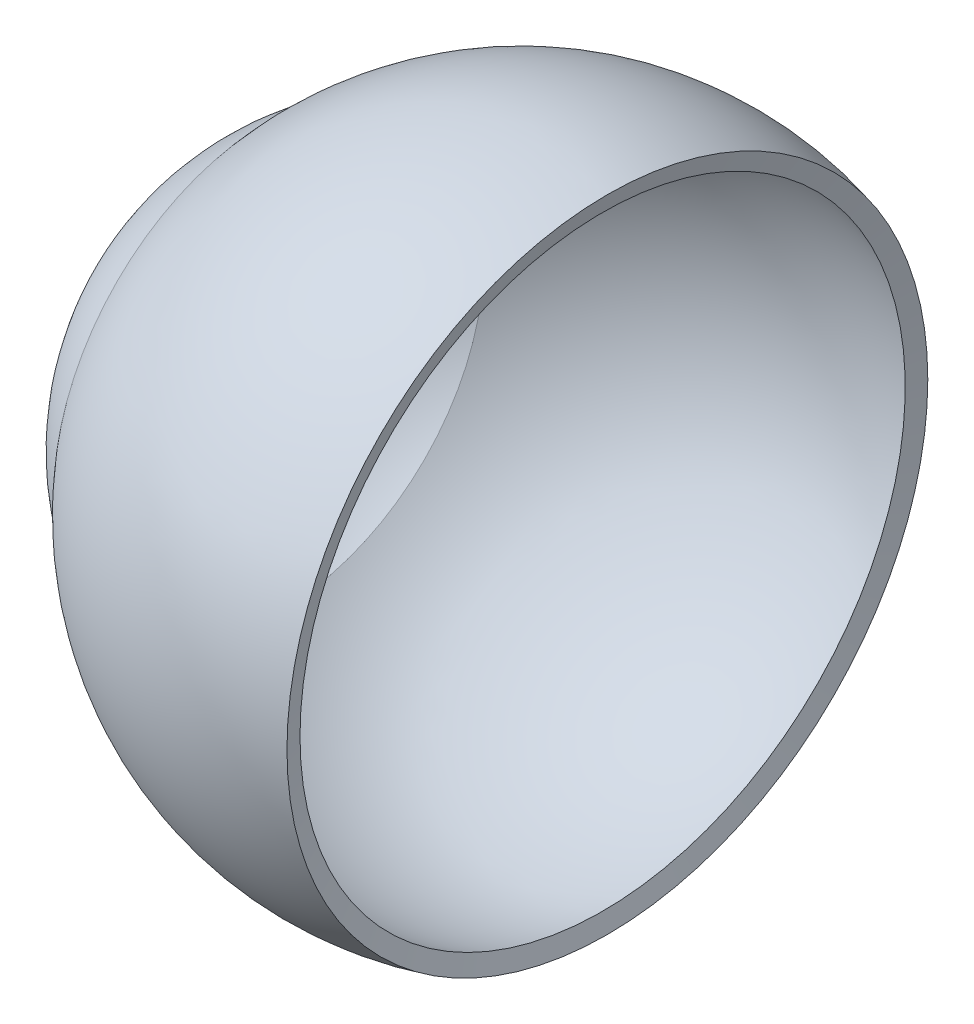
ISO-10303-21;
HEADER;
FILE_DESCRIPTION(('STEP AP214'),'2;1');
FILE_NAME('part.step','',(''),(''),'','','');
FILE_SCHEMA(('AUTOMOTIVE_DESIGN { 1 0 10303 214 1 1 1 1 }'));
ENDSEC;
DATA;
#1=APPLICATION_CONTEXT('core data for automotive mechanical design processes');
#2=APPLICATION_PROTOCOL_DEFINITION('international standard','automotive_design',2000,#1);
#3=PRODUCT_CONTEXT('',#1,'mechanical');
#4=PRODUCT('Part','Part','',(#3));
#5=PRODUCT_RELATED_PRODUCT_CATEGORY('part','',(#4));
#6=PRODUCT_DEFINITION_FORMATION('','',#4);
#7=PRODUCT_DEFINITION_CONTEXT('part definition',#1,'design');
#8=PRODUCT_DEFINITION('design','',#6,#7);
#9=PRODUCT_DEFINITION_SHAPE('','',#8);
#10=(LENGTH_UNIT() NAMED_UNIT(*) SI_UNIT(.MILLI.,.METRE.));
#11=(NAMED_UNIT(*) PLANE_ANGLE_UNIT() SI_UNIT($,.RADIAN.));
#12=(NAMED_UNIT(*) SI_UNIT($,.STERADIAN.) SOLID_ANGLE_UNIT());
#13=UNCERTAINTY_MEASURE_WITH_UNIT(LENGTH_MEASURE(1.E-05),#10,'distance_accuracy_value','');
#14=(GEOMETRIC_REPRESENTATION_CONTEXT(3) GLOBAL_UNCERTAINTY_ASSIGNED_CONTEXT((#13)) GLOBAL_UNIT_ASSIGNED_CONTEXT((#10,
#11,#12)) REPRESENTATION_CONTEXT('',''));
#15=CARTESIAN_POINT('',(0.,0.,0.));
#16=DIRECTION('',(0.,0.,1.));
#17=DIRECTION('',(1.,0.,0.));
#18=AXIS2_PLACEMENT_3D('',#15,#16,#17);
#19=CARTESIAN_POINT('',(0.,0.,0.));
#20=DIRECTION('',(-1.,0.,0.));
#21=DIRECTION('',(0.,1.,0.));
#22=AXIS2_PLACEMENT_3D('',#19,#20,#21);
#23=SPHERICAL_SURFACE('',#22,9.);
#24=CARTESIAN_POINT('',(-6.83333333333333,0.,0.));
#25=DIRECTION('',(-1.,0.,0.));
#26=DIRECTION('',(0.,0.,1.));
#27=AXIS2_PLACEMENT_3D('',#24,#25,#26);
#28=CIRCLE('',#27,5.85709446360186);
#29=CARTESIAN_POINT('',(-6.83333333333333,0.,5.85709446360186));
#30=VERTEX_POINT('',#29);
#31=EDGE_CURVE('E10',#30,#30,#28,.T.);
#32=ORIENTED_EDGE('',*,*,#31,.F.);
#33=EDGE_LOOP('',(#32));
#34=FACE_BOUND('',#33,.T.);
#35=CARTESIAN_POINT('',(2.32937140592266,0.,0.));
#36=DIRECTION('',(-1.,0.,0.));
#37=DIRECTION('',(0.,0.,1.));
#38=AXIS2_PLACEMENT_3D('',#35,#36,#37);
#39=CIRCLE('',#38,8.69333243660162);
#40=CARTESIAN_POINT('',(2.32937140592266,0.,8.69333243660162));
#41=VERTEX_POINT('',#40);
#42=EDGE_CURVE('E56',#41,#41,#39,.T.);
#43=ORIENTED_EDGE('',*,*,#42,.T.);
#44=EDGE_LOOP('',(#43));
#45=FACE_BOUND('',#44,.T.);
#46=ADVANCED_FACE('F39',(#34,#45),#23,.T.);
#47=CARTESIAN_POINT('',(-3.,0.,0.));
#48=DIRECTION('',(-1.,0.,0.));
#49=DIRECTION('',(0.,1.,0.));
#50=AXIS2_PLACEMENT_3D('',#47,#48,#49);
#51=SPHERICAL_SURFACE('',#50,7.);
#52=ORIENTED_EDGE('',*,*,#31,.T.);
#53=EDGE_LOOP('',(#52));
#54=FACE_BOUND('',#53,.T.);
#55=ADVANCED_FACE('F77',(#54),#51,.T.);
#56=CARTESIAN_POINT('',(-3.,0.,0.));
#57=DIRECTION('',(-1.,0.,0.));
#58=DIRECTION('',(0.,1.,0.));
#59=AXIS2_PLACEMENT_3D('',#56,#57,#58);
#60=SPHERICAL_SURFACE('',#59,6.5);
#61=CARTESIAN_POINT('',(-6.5,0.,0.));
#62=DIRECTION('',(-1.,0.,0.));
#63=DIRECTION('',(0.,0.,1.));
#64=AXIS2_PLACEMENT_3D('',#61,#62,#63);
#65=CIRCLE('',#64,5.47722557505166);
#66=CARTESIAN_POINT('',(-6.5,0.,5.47722557505166));
#67=VERTEX_POINT('',#66);
#68=EDGE_CURVE('E46',#67,#67,#65,.T.);
#69=ORIENTED_EDGE('',*,*,#68,.F.);
#70=EDGE_LOOP('',(#69));
#71=FACE_BOUND('',#70,.T.);
#72=ADVANCED_FACE('F72',(#71),#60,.F.);
#73=CARTESIAN_POINT('',(0.,0.,0.));
#74=DIRECTION('',(-1.,0.,0.));
#75=DIRECTION('',(0.,1.,0.));
#76=AXIS2_PLACEMENT_3D('',#73,#74,#75);
#77=SPHERICAL_SURFACE('',#76,8.5);
#78=CARTESIAN_POINT('',(2.1999618833714,0.,0.));
#79=DIRECTION('',(-1.,0.,0.));
#80=DIRECTION('',(0.,0.,1.));
#81=AXIS2_PLACEMENT_3D('',#78,#79,#80);
#82=CIRCLE('',#81,8.21036952345709);
#83=CARTESIAN_POINT('',(2.1999618833714,0.,8.21036952345709));
#84=VERTEX_POINT('',#83);
#85=EDGE_CURVE('E51',#84,#84,#82,.T.);
#86=ORIENTED_EDGE('',*,*,#85,.F.);
#87=EDGE_LOOP('',(#86));
#88=FACE_BOUND('',#87,.T.);
#89=ORIENTED_EDGE('',*,*,#68,.T.);
#90=EDGE_LOOP('',(#89));
#91=FACE_BOUND('',#90,.T.);
#92=ADVANCED_FACE('F67',(#88,#91),#77,.F.);
#93=CARTESIAN_POINT('',(2.1999618833714,0.,0.));
#94=DIRECTION('',(1.,0.,0.));
#95=DIRECTION('',(0.,0.,-1.));
#96=AXIS2_PLACEMENT_3D('',#93,#94,#95);
#97=CONICAL_SURFACE('',#96,8.21036952345709,1.30899693899575);
#98=ORIENTED_EDGE('',*,*,#42,.F.);
#99=EDGE_LOOP('',(#98));
#100=FACE_BOUND('',#99,.T.);
#101=ORIENTED_EDGE('',*,*,#85,.T.);
#102=EDGE_LOOP('',(#101));
#103=FACE_BOUND('',#102,.T.);
#104=ADVANCED_FACE('F64',(#100,#103),#97,.F.);
#105=CLOSED_SHELL('',(#46,#55,#72,#92,#104));
#106=MANIFOLD_SOLID_BREP('B2',#105);
#107=ADVANCED_BREP_SHAPE_REPRESENTATION('',(#18,#106),#14);
#108=SHAPE_DEFINITION_REPRESENTATION(#9,#107);
ENDSEC;
END-ISO-10303-21;
